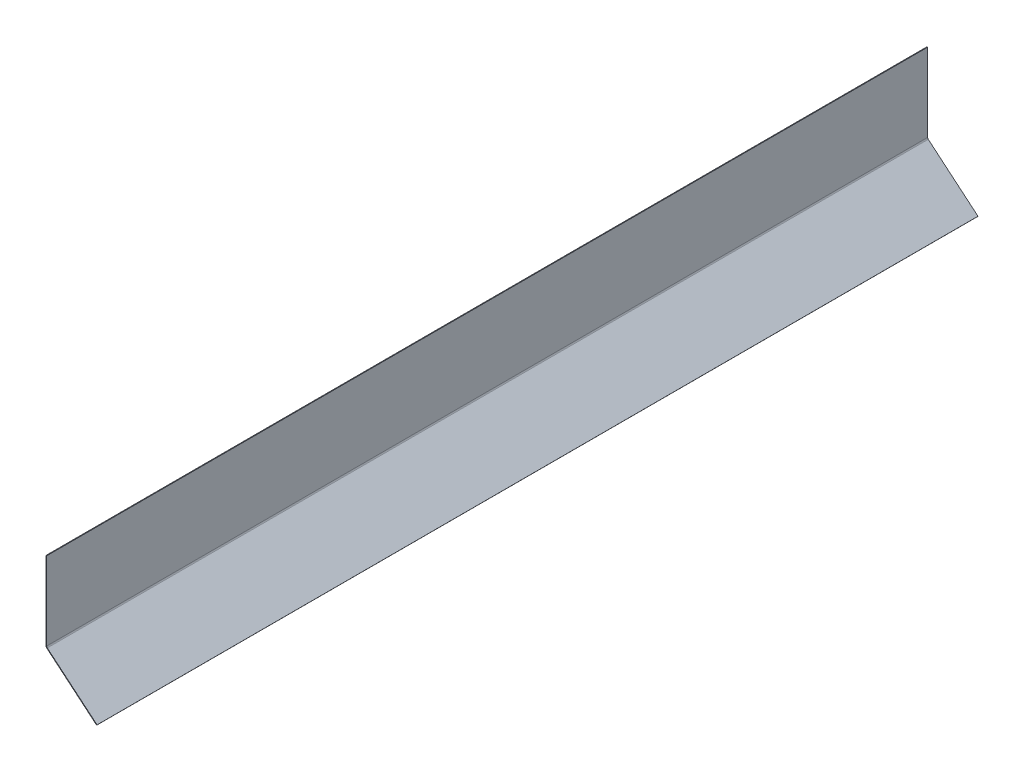
ISO-10303-21;
HEADER;
FILE_DESCRIPTION(('STEP AP214'),'2;1');
FILE_NAME('part.step','',(''),(''),'','','');
FILE_SCHEMA(('AUTOMOTIVE_DESIGN { 1 0 10303 214 1 1 1 1 }'));
ENDSEC;
DATA;
#1=APPLICATION_CONTEXT('core data for automotive mechanical design processes');
#2=APPLICATION_PROTOCOL_DEFINITION('international standard','automotive_design',2000,#1);
#3=PRODUCT_CONTEXT('',#1,'mechanical');
#4=PRODUCT('Part','Part','',(#3));
#5=PRODUCT_RELATED_PRODUCT_CATEGORY('part','',(#4));
#6=PRODUCT_DEFINITION_FORMATION('','',#4);
#7=PRODUCT_DEFINITION_CONTEXT('part definition',#1,'design');
#8=PRODUCT_DEFINITION('design','',#6,#7);
#9=PRODUCT_DEFINITION_SHAPE('','',#8);
#10=(LENGTH_UNIT() NAMED_UNIT(*) SI_UNIT(.MILLI.,.METRE.));
#11=(NAMED_UNIT(*) PLANE_ANGLE_UNIT() SI_UNIT($,.RADIAN.));
#12=(NAMED_UNIT(*) SI_UNIT($,.STERADIAN.) SOLID_ANGLE_UNIT());
#13=UNCERTAINTY_MEASURE_WITH_UNIT(LENGTH_MEASURE(1.E-05),#10,'distance_accuracy_value','');
#14=(GEOMETRIC_REPRESENTATION_CONTEXT(3) GLOBAL_UNCERTAINTY_ASSIGNED_CONTEXT((#13)) GLOBAL_UNIT_ASSIGNED_CONTEXT((#10,
#11,#12)) REPRESENTATION_CONTEXT('',''));
#15=CARTESIAN_POINT('',(0.,0.,0.));
#16=DIRECTION('',(0.,0.,1.));
#17=DIRECTION('',(1.,0.,0.));
#18=AXIS2_PLACEMENT_3D('',#15,#16,#17);
#19=CARTESIAN_POINT('',(-13.7757750665724,-120.209632649712,-1000.));
#20=DIRECTION('',(0.,0.,-1.));
#21=DIRECTION('',(-1.,0.,0.));
#22=AXIS2_PLACEMENT_3D('',#19,#20,#21);
#23=PLANE('',#22);
#24=DIRECTION('',(0.642787609686538,0.766044443118979,0.));
#25=VECTOR('',#24,1.);
#26=CARTESIAN_POINT('',(-13.7757750665724,-120.209632649712,-1000.));
#27=LINE('',#26,#25);
#28=CARTESIAN_POINT('',(-13.7757750665724,-120.209632649712,-1000.));
#29=VERTEX_POINT('',#28);
#30=CARTESIAN_POINT('',(-12.8115936520426,-119.060565985033,-1000.));
#31=VERTEX_POINT('',#30);
#32=EDGE_CURVE('E11',#29,#31,#27,.T.);
#33=ORIENTED_EDGE('',*,*,#32,.F.);
#34=CARTESIAN_POINT('',(-10.2404432132965,-115.996388212557,-1000.));
#35=DIRECTION('',(0.,0.,-1.));
#36=DIRECTION('',(-1.,0.,0.));
#37=AXIS2_PLACEMENT_3D('',#34,#35,#36);
#38=CIRCLE('',#37,5.5);
#39=CARTESIAN_POINT('',(-15.7404432132964,-115.996388212557,-1000.));
#40=VERTEX_POINT('',#39);
#41=EDGE_CURVE('E135',#40,#29,#38,.F.);
#42=ORIENTED_EDGE('',*,*,#41,.F.);
#43=DIRECTION('',(-1.,0.,0.));
#44=VECTOR('',#43,1.);
#45=CARTESIAN_POINT('',(-14.2404432132965,-115.996388212557,-1000.));
#46=LINE('',#45,#44);
#47=CARTESIAN_POINT('',(-14.2404432132965,-115.996388212557,-1000.));
#48=VERTEX_POINT('',#47);
#49=EDGE_CURVE('E46',#48,#40,#46,.T.);
#50=ORIENTED_EDGE('',*,*,#49,.F.);
#51=CARTESIAN_POINT('',(-10.2404432132965,-115.996388212557,-1000.));
#52=DIRECTION('',(0.,0.,1.));
#53=DIRECTION('',(1.,0.,0.));
#54=AXIS2_PLACEMENT_3D('',#51,#52,#53);
#55=CIRCLE('',#54,4.);
#56=EDGE_CURVE('E187',#48,#31,#55,.T.);
#57=ORIENTED_EDGE('',*,*,#56,.T.);
#58=EDGE_LOOP('',(#33,#42,#50,#57));
#59=FACE_BOUND('',#58,.T.);
#60=ADVANCED_FACE('F38',(#59),#23,.T.);
#61=CARTESIAN_POINT('',(-14.2404432132965,-115.996388212557,-1000.));
#62=DIRECTION('',(0.,0.,-1.));
#63=DIRECTION('',(-1.,0.,0.));
#64=AXIS2_PLACEMENT_3D('',#61,#62,#63);
#65=PLANE('',#64);
#66=DIRECTION('',(0.76604444311898,-0.642787609686537,0.));
#67=VECTOR('',#66,1.);
#68=CARTESIAN_POINT('',(-15.7404432132964,-118.56108033241,-1000.));
#69=LINE('',#68,#67);
#70=CARTESIAN_POINT('',(99.1662232545505,-214.979221785391,-1000.));
#71=VERTEX_POINT('',#70);
#72=EDGE_CURVE('E160',#29,#71,#69,.T.);
#73=ORIENTED_EDGE('',*,*,#72,.F.);
#74=ORIENTED_EDGE('',*,*,#32,.T.);
#75=DIRECTION('',(0.76604444311898,-0.642787609686537,0.));
#76=VECTOR('',#75,1.);
#77=CARTESIAN_POINT('',(-14.7762617987666,-117.412013667732,-1000.));
#78=LINE('',#77,#76);
#79=CARTESIAN_POINT('',(100.13040466908,-213.830155120712,-1000.));
#80=VERTEX_POINT('',#79);
#81=EDGE_CURVE('E203',#31,#80,#78,.T.);
#82=ORIENTED_EDGE('',*,*,#81,.T.);
#83=DIRECTION('',(-0.642787609686528,-0.766044443118987,0.));
#84=VECTOR('',#83,1.);
#85=CARTESIAN_POINT('',(100.13040466908,-213.830155120712,-1000.));
#86=LINE('',#85,#84);
#87=EDGE_CURVE('E97',#80,#71,#86,.T.);
#88=ORIENTED_EDGE('',*,*,#87,.T.);
#89=EDGE_LOOP('',(#73,#74,#82,#88));
#90=FACE_BOUND('',#89,.T.);
#91=ADVANCED_FACE('F208',(#90),#65,.T.);
#92=CARTESIAN_POINT('',(-15.7404432132964,-115.996388212557,1000.));
#93=DIRECTION('',(0.,0.,1.));
#94=DIRECTION('',(1.,0.,0.));
#95=AXIS2_PLACEMENT_3D('',#92,#93,#94);
#96=PLANE('',#95);
#97=DIRECTION('',(1.,0.,0.));
#98=VECTOR('',#97,1.);
#99=CARTESIAN_POINT('',(-15.7404432132964,-115.996388212557,1000.));
#100=LINE('',#99,#98);
#101=CARTESIAN_POINT('',(-15.7404432132964,-115.996388212557,1000.));
#102=VERTEX_POINT('',#101);
#103=CARTESIAN_POINT('',(-14.2404432132965,-115.996388212557,1000.));
#104=VERTEX_POINT('',#103);
#105=EDGE_CURVE('E81',#102,#104,#100,.T.);
#106=ORIENTED_EDGE('',*,*,#105,.F.);
#107=CARTESIAN_POINT('',(-10.2404432132965,-115.996388212557,1000.));
#108=DIRECTION('',(0.,0.,-1.));
#109=DIRECTION('',(-1.,0.,0.));
#110=AXIS2_PLACEMENT_3D('',#107,#108,#109);
#111=CIRCLE('',#110,5.5);
#112=CARTESIAN_POINT('',(-13.7757750665724,-120.209632649712,1000.));
#113=VERTEX_POINT('',#112);
#114=EDGE_CURVE('E158',#102,#113,#111,.F.);
#115=ORIENTED_EDGE('',*,*,#114,.T.);
#116=DIRECTION('',(-0.642787609686538,-0.766044443118979,0.));
#117=VECTOR('',#116,1.);
#118=CARTESIAN_POINT('',(-12.8115936520426,-119.060565985033,1000.));
#119=LINE('',#118,#117);
#120=CARTESIAN_POINT('',(-12.8115936520426,-119.060565985033,1000.));
#121=VERTEX_POINT('',#120);
#122=EDGE_CURVE('E88',#121,#113,#119,.T.);
#123=ORIENTED_EDGE('',*,*,#122,.F.);
#124=CARTESIAN_POINT('',(-10.2404432132965,-115.996388212557,1000.));
#125=DIRECTION('',(0.,0.,1.));
#126=DIRECTION('',(1.,0.,0.));
#127=AXIS2_PLACEMENT_3D('',#124,#125,#126);
#128=CIRCLE('',#127,4.);
#129=EDGE_CURVE('E149',#104,#121,#128,.T.);
#130=ORIENTED_EDGE('',*,*,#129,.F.);
#131=EDGE_LOOP('',(#106,#115,#123,#130));
#132=FACE_BOUND('',#131,.T.);
#133=ADVANCED_FACE('F188',(#132),#96,.T.);
#134=CARTESIAN_POINT('',(-12.8115936520426,-119.060565985033,1000.));
#135=DIRECTION('',(0.,0.,1.));
#136=DIRECTION('',(1.,0.,0.));
#137=AXIS2_PLACEMENT_3D('',#134,#135,#136);
#138=PLANE('',#137);
#139=DIRECTION('',(0.,-1.,0.));
#140=VECTOR('',#139,1.);
#141=CARTESIAN_POINT('',(-15.7404432132964,61.43891966759,1000.));
#142=LINE('',#141,#140);
#143=CARTESIAN_POINT('',(-15.7404432132964,61.43891966759,1000.));
#144=VERTEX_POINT('',#143);
#145=EDGE_CURVE('E118',#144,#102,#142,.T.);
#146=ORIENTED_EDGE('',*,*,#145,.T.);
#147=ORIENTED_EDGE('',*,*,#105,.T.);
#148=DIRECTION('',(0.,-1.,0.));
#149=VECTOR('',#148,1.);
#150=CARTESIAN_POINT('',(-14.2404432132964,61.43891966759,1000.));
#151=LINE('',#150,#149);
#152=CARTESIAN_POINT('',(-14.2404432132964,61.43891966759,1000.));
#153=VERTEX_POINT('',#152);
#154=EDGE_CURVE('E152',#153,#104,#151,.T.);
#155=ORIENTED_EDGE('',*,*,#154,.F.);
#156=DIRECTION('',(1.,0.,0.));
#157=VECTOR('',#156,1.);
#158=CARTESIAN_POINT('',(-15.7404432132964,61.43891966759,1000.));
#159=LINE('',#158,#157);
#160=EDGE_CURVE('E155',#144,#153,#159,.T.);
#161=ORIENTED_EDGE('',*,*,#160,.F.);
#162=EDGE_LOOP('',(#146,#147,#155,#161));
#163=FACE_BOUND('',#162,.T.);
#164=ADVANCED_FACE('F178',(#163),#138,.T.);
#165=CARTESIAN_POINT('',(-15.7404432132964,-118.56108033241,-1000.));
#166=DIRECTION('',(-0.642787609686537,-0.76604444311898,0.));
#167=DIRECTION('',(0.76604444311898,-0.642787609686537,0.));
#168=AXIS2_PLACEMENT_3D('',#165,#166,#167);
#169=PLANE('',#168);
#170=DIRECTION('',(0.76604444311898,-0.642787609686537,0.));
#171=VECTOR('',#170,1.);
#172=CARTESIAN_POINT('',(-15.7404432132964,-118.56108033241,1000.));
#173=LINE('',#172,#171);
#174=CARTESIAN_POINT('',(99.1662232545505,-214.979221785391,1000.));
#175=VERTEX_POINT('',#174);
#176=EDGE_CURVE('E142',#113,#175,#173,.T.);
#177=ORIENTED_EDGE('',*,*,#176,.F.);
#178=DIRECTION('',(0.,0.,1.));
#179=VECTOR('',#178,1.);
#180=CARTESIAN_POINT('',(-13.7757750665724,-120.209632649712,-1000.));
#181=LINE('',#180,#179);
#182=EDGE_CURVE('E161',#29,#113,#181,.T.);
#183=ORIENTED_EDGE('',*,*,#182,.F.);
#184=ORIENTED_EDGE('',*,*,#72,.T.);
#185=DIRECTION('',(0.,0.,1.));
#186=VECTOR('',#185,1.);
#187=CARTESIAN_POINT('',(99.1662232545505,-214.979221785391,-1000.));
#188=LINE('',#187,#186);
#189=EDGE_CURVE('E138',#71,#175,#188,.T.);
#190=ORIENTED_EDGE('',*,*,#189,.T.);
#191=EDGE_LOOP('',(#177,#183,#184,#190));
#192=FACE_BOUND('',#191,.T.);
#193=ADVANCED_FACE('F194',(#192),#169,.T.);
#194=CARTESIAN_POINT('',(-10.2404432132965,-115.996388212557,-1000.));
#195=DIRECTION('',(0.,0.,1.));
#196=DIRECTION('',(1.,0.,0.));
#197=AXIS2_PLACEMENT_3D('',#194,#195,#196);
#198=CYLINDRICAL_SURFACE('',#197,5.5);
#199=ORIENTED_EDGE('',*,*,#114,.F.);
#200=DIRECTION('',(0.,0.,1.));
#201=VECTOR('',#200,1.);
#202=CARTESIAN_POINT('',(-15.7404432132964,-115.996388212557,-1000.));
#203=LINE('',#202,#201);
#204=EDGE_CURVE('E121',#40,#102,#203,.T.);
#205=ORIENTED_EDGE('',*,*,#204,.F.);
#206=ORIENTED_EDGE('',*,*,#41,.T.);
#207=ORIENTED_EDGE('',*,*,#182,.T.);
#208=EDGE_LOOP('',(#199,#205,#206,#207));
#209=FACE_BOUND('',#208,.T.);
#210=ADVANCED_FACE('F190',(#209),#198,.T.);
#211=CARTESIAN_POINT('',(-15.7404432132964,61.43891966759,-1000.));
#212=DIRECTION('',(-1.,0.,0.));
#213=DIRECTION('',(0.,-1.,0.));
#214=AXIS2_PLACEMENT_3D('',#211,#212,#213);
#215=PLANE('',#214);
#216=ORIENTED_EDGE('',*,*,#145,.F.);
#217=DIRECTION('',(0.,0.,1.));
#218=VECTOR('',#217,1.);
#219=CARTESIAN_POINT('',(-15.7404432132964,61.43891966759,-1000.));
#220=LINE('',#219,#218);
#221=CARTESIAN_POINT('',(-15.7404432132964,61.43891966759,-1000.));
#222=VERTEX_POINT('',#221);
#223=EDGE_CURVE('E112',#222,#144,#220,.T.);
#224=ORIENTED_EDGE('',*,*,#223,.F.);
#225=DIRECTION('',(0.,-1.,0.));
#226=VECTOR('',#225,1.);
#227=CARTESIAN_POINT('',(-15.7404432132964,61.43891966759,-1000.));
#228=LINE('',#227,#226);
#229=EDGE_CURVE('E116',#222,#40,#228,.T.);
#230=ORIENTED_EDGE('',*,*,#229,.T.);
#231=ORIENTED_EDGE('',*,*,#204,.T.);
#232=EDGE_LOOP('',(#216,#224,#230,#231));
#233=FACE_BOUND('',#232,.T.);
#234=ADVANCED_FACE('F114',(#233),#215,.T.);
#235=CARTESIAN_POINT('',(-15.7404432132964,61.43891966759,-1000.));
#236=DIRECTION('',(0.,-1.,0.));
#237=DIRECTION('',(0.,0.,-1.));
#238=AXIS2_PLACEMENT_3D('',#235,#236,#237);
#239=PLANE('',#238);
#240=ORIENTED_EDGE('',*,*,#160,.T.);
#241=DIRECTION('',(0.,0.,1.));
#242=VECTOR('',#241,1.);
#243=CARTESIAN_POINT('',(-14.2404432132964,61.43891966759,-1000.));
#244=LINE('',#243,#242);
#245=CARTESIAN_POINT('',(-14.2404432132964,61.43891966759,-1000.));
#246=VERTEX_POINT('',#245);
#247=EDGE_CURVE('E122',#246,#153,#244,.T.);
#248=ORIENTED_EDGE('',*,*,#247,.F.);
#249=DIRECTION('',(1.,0.,0.));
#250=VECTOR('',#249,1.);
#251=CARTESIAN_POINT('',(-15.7404432132964,61.43891966759,-1000.));
#252=LINE('',#251,#250);
#253=EDGE_CURVE('E125',#222,#246,#252,.T.);
#254=ORIENTED_EDGE('',*,*,#253,.F.);
#255=ORIENTED_EDGE('',*,*,#223,.T.);
#256=EDGE_LOOP('',(#240,#248,#254,#255));
#257=FACE_BOUND('',#256,.T.);
#258=ADVANCED_FACE('F126',(#257),#239,.F.);
#259=CARTESIAN_POINT('',(-14.2404432132964,61.43891966759,-1000.));
#260=DIRECTION('',(-1.,0.,0.));
#261=DIRECTION('',(0.,-1.,0.));
#262=AXIS2_PLACEMENT_3D('',#259,#260,#261);
#263=PLANE('',#262);
#264=ORIENTED_EDGE('',*,*,#154,.T.);
#265=DIRECTION('',(0.,0.,1.));
#266=VECTOR('',#265,1.);
#267=CARTESIAN_POINT('',(-14.2404432132965,-115.996388212557,-1000.));
#268=LINE('',#267,#266);
#269=EDGE_CURVE('E165',#48,#104,#268,.T.);
#270=ORIENTED_EDGE('',*,*,#269,.F.);
#271=DIRECTION('',(0.,-1.,0.));
#272=VECTOR('',#271,1.);
#273=CARTESIAN_POINT('',(-14.2404432132964,61.43891966759,-1000.));
#274=LINE('',#273,#272);
#275=EDGE_CURVE('E131',#246,#48,#274,.T.);
#276=ORIENTED_EDGE('',*,*,#275,.F.);
#277=ORIENTED_EDGE('',*,*,#247,.T.);
#278=EDGE_LOOP('',(#264,#270,#276,#277));
#279=FACE_BOUND('',#278,.T.);
#280=ADVANCED_FACE('F182',(#279),#263,.F.);
#281=CARTESIAN_POINT('',(-10.2404432132965,-115.996388212557,-1000.));
#282=DIRECTION('',(0.,0.,1.));
#283=DIRECTION('',(1.,0.,0.));
#284=AXIS2_PLACEMENT_3D('',#281,#282,#283);
#285=CYLINDRICAL_SURFACE('',#284,4.);
#286=ORIENTED_EDGE('',*,*,#129,.T.);
#287=DIRECTION('',(0.,0.,1.));
#288=VECTOR('',#287,1.);
#289=CARTESIAN_POINT('',(-12.8115936520426,-119.060565985033,-1000.));
#290=LINE('',#289,#288);
#291=EDGE_CURVE('E168',#31,#121,#290,.T.);
#292=ORIENTED_EDGE('',*,*,#291,.F.);
#293=ORIENTED_EDGE('',*,*,#56,.F.);
#294=ORIENTED_EDGE('',*,*,#269,.T.);
#295=EDGE_LOOP('',(#286,#292,#293,#294));
#296=FACE_BOUND('',#295,.T.);
#297=ADVANCED_FACE('F185',(#296),#285,.F.);
#298=CARTESIAN_POINT('',(-14.7762617987666,-117.412013667732,-1000.));
#299=DIRECTION('',(-0.642787609686537,-0.76604444311898,0.));
#300=DIRECTION('',(0.76604444311898,-0.642787609686537,0.));
#301=AXIS2_PLACEMENT_3D('',#298,#299,#300);
#302=PLANE('',#301);
#303=DIRECTION('',(0.76604444311898,-0.642787609686537,0.));
#304=VECTOR('',#303,1.);
#305=CARTESIAN_POINT('',(-14.7762617987666,-117.412013667732,1000.));
#306=LINE('',#305,#304);
#307=CARTESIAN_POINT('',(100.13040466908,-213.830155120712,1000.));
#308=VERTEX_POINT('',#307);
#309=EDGE_CURVE('E147',#121,#308,#306,.T.);
#310=ORIENTED_EDGE('',*,*,#309,.T.);
#311=DIRECTION('',(0.,0.,1.));
#312=VECTOR('',#311,1.);
#313=CARTESIAN_POINT('',(100.13040466908,-213.830155120712,-1000.));
#314=LINE('',#313,#312);
#315=EDGE_CURVE('E171',#80,#308,#314,.T.);
#316=ORIENTED_EDGE('',*,*,#315,.F.);
#317=ORIENTED_EDGE('',*,*,#81,.F.);
#318=ORIENTED_EDGE('',*,*,#291,.T.);
#319=EDGE_LOOP('',(#310,#316,#317,#318));
#320=FACE_BOUND('',#319,.T.);
#321=ADVANCED_FACE('F202',(#320),#302,.F.);
#322=CARTESIAN_POINT('',(100.13040466908,-213.830155120712,-1000.));
#323=DIRECTION('',(-0.766044443118987,0.642787609686528,0.));
#324=DIRECTION('',(-0.642787609686528,-0.766044443118987,0.));
#325=AXIS2_PLACEMENT_3D('',#322,#323,#324);
#326=PLANE('',#325);
#327=DIRECTION('',(-0.642787609686528,-0.766044443118987,0.));
#328=VECTOR('',#327,1.);
#329=CARTESIAN_POINT('',(100.13040466908,-213.830155120712,1000.));
#330=LINE('',#329,#328);
#331=EDGE_CURVE('E144',#308,#175,#330,.T.);
#332=ORIENTED_EDGE('',*,*,#331,.T.);
#333=ORIENTED_EDGE('',*,*,#189,.F.);
#334=ORIENTED_EDGE('',*,*,#87,.F.);
#335=ORIENTED_EDGE('',*,*,#315,.T.);
#336=EDGE_LOOP('',(#332,#333,#334,#335));
#337=FACE_BOUND('',#336,.T.);
#338=ADVANCED_FACE('F198',(#337),#326,.F.);
#339=CARTESIAN_POINT('',(-10.2404432132965,-115.996388212557,-1000.));
#340=DIRECTION('',(0.,0.,1.));
#341=DIRECTION('',(1.,0.,0.));
#342=AXIS2_PLACEMENT_3D('',#339,#340,#341);
#343=PLANE('',#342);
#344=ORIENTED_EDGE('',*,*,#275,.T.);
#345=ORIENTED_EDGE('',*,*,#49,.T.);
#346=ORIENTED_EDGE('',*,*,#229,.F.);
#347=ORIENTED_EDGE('',*,*,#253,.T.);
#348=EDGE_LOOP('',(#344,#345,#346,#347));
#349=FACE_BOUND('',#348,.T.);
#350=ADVANCED_FACE('F133',(#349),#343,.F.);
#351=CARTESIAN_POINT('',(-10.2404432132965,-115.996388212557,1000.));
#352=DIRECTION('',(0.,0.,1.));
#353=DIRECTION('',(1.,0.,0.));
#354=AXIS2_PLACEMENT_3D('',#351,#352,#353);
#355=PLANE('',#354);
#356=ORIENTED_EDGE('',*,*,#176,.T.);
#357=ORIENTED_EDGE('',*,*,#331,.F.);
#358=ORIENTED_EDGE('',*,*,#309,.F.);
#359=ORIENTED_EDGE('',*,*,#122,.T.);
#360=EDGE_LOOP('',(#356,#357,#358,#359));
#361=FACE_BOUND('',#360,.T.);
#362=ADVANCED_FACE('F196',(#361),#355,.T.);
#363=CLOSED_SHELL('',(#60,#91,#133,#164,#193,#210,#234,#258,#280,#297,#321,#338,#350,#362));
#364=MANIFOLD_SOLID_BREP('B2',#363);
#365=ADVANCED_BREP_SHAPE_REPRESENTATION('',(#18,#364),#14);
#366=SHAPE_DEFINITION_REPRESENTATION(#9,#365);
ENDSEC;
END-ISO-10303-21;
